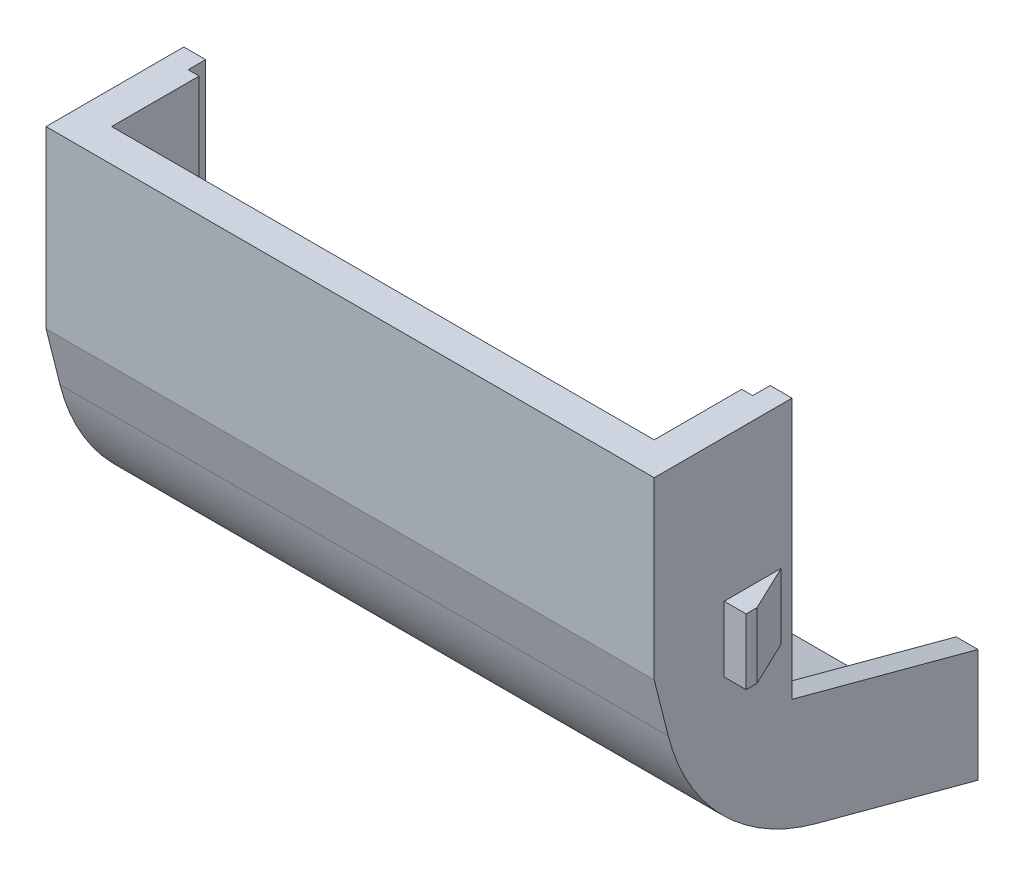
ISO-10303-21;
HEADER;
FILE_DESCRIPTION(('STEP AP214'),'2;1');
FILE_NAME('part.step','',(''),(''),'','','');
FILE_SCHEMA(('AUTOMOTIVE_DESIGN { 1 0 10303 214 1 1 1 1 }'));
ENDSEC;
DATA;
#1=APPLICATION_CONTEXT('core data for automotive mechanical design processes');
#2=APPLICATION_PROTOCOL_DEFINITION('international standard','automotive_design',2000,#1);
#3=PRODUCT_CONTEXT('',#1,'mechanical');
#4=PRODUCT('Part','Part','',(#3));
#5=PRODUCT_RELATED_PRODUCT_CATEGORY('part','',(#4));
#6=PRODUCT_DEFINITION_FORMATION('','',#4);
#7=PRODUCT_DEFINITION_CONTEXT('part definition',#1,'design');
#8=PRODUCT_DEFINITION('design','',#6,#7);
#9=PRODUCT_DEFINITION_SHAPE('','',#8);
#10=(LENGTH_UNIT() NAMED_UNIT(*) SI_UNIT(.MILLI.,.METRE.));
#11=(NAMED_UNIT(*) PLANE_ANGLE_UNIT() SI_UNIT($,.RADIAN.));
#12=(NAMED_UNIT(*) SI_UNIT($,.STERADIAN.) SOLID_ANGLE_UNIT());
#13=UNCERTAINTY_MEASURE_WITH_UNIT(LENGTH_MEASURE(1.E-05),#10,'distance_accuracy_value','');
#14=(GEOMETRIC_REPRESENTATION_CONTEXT(3) GLOBAL_UNCERTAINTY_ASSIGNED_CONTEXT((#13)) GLOBAL_UNIT_ASSIGNED_CONTEXT((#10,
#11,#12)) REPRESENTATION_CONTEXT('',''));
#15=CARTESIAN_POINT('',(0.,0.,0.));
#16=DIRECTION('',(0.,0.,1.));
#17=DIRECTION('',(1.,0.,0.));
#18=AXIS2_PLACEMENT_3D('',#15,#16,#17);
#19=CARTESIAN_POINT('',(0.,0.,7.8));
#20=DIRECTION('',(0.,1.,0.));
#21=DIRECTION('',(0.,0.,1.));
#22=AXIS2_PLACEMENT_3D('',#19,#20,#21);
#23=PLANE('',#22);
#24=DIRECTION('',(0.,0.,-1.));
#25=VECTOR('',#24,1.);
#26=CARTESIAN_POINT('',(1.5,0.,1.5));
#27=LINE('',#26,#25);
#28=CARTESIAN_POINT('',(1.5,0.,6.3));
#29=VERTEX_POINT('',#28);
#30=CARTESIAN_POINT('',(1.5,0.,2.3));
#31=VERTEX_POINT('',#30);
#32=EDGE_CURVE('E500',#29,#31,#27,.T.);
#33=ORIENTED_EDGE('',*,*,#32,.T.);
#34=DIRECTION('',(1.,0.,0.));
#35=VECTOR('',#34,1.);
#36=CARTESIAN_POINT('',(1.,0.,2.3));
#37=LINE('',#36,#35);
#38=CARTESIAN_POINT('',(1.,0.,2.3));
#39=VERTEX_POINT('',#38);
#40=EDGE_CURVE('E255',#39,#31,#37,.T.);
#41=ORIENTED_EDGE('',*,*,#40,.F.);
#42=DIRECTION('',(0.,0.,-1.));
#43=VECTOR('',#42,1.);
#44=CARTESIAN_POINT('',(1.,0.,2.3));
#45=LINE('',#44,#43);
#46=CARTESIAN_POINT('',(1.,0.,1.5));
#47=VERTEX_POINT('',#46);
#48=EDGE_CURVE('E241',#39,#47,#45,.T.);
#49=ORIENTED_EDGE('',*,*,#48,.T.);
#50=DIRECTION('',(1.,0.,0.));
#51=VECTOR('',#50,1.);
#52=CARTESIAN_POINT('',(0.,0.,1.5));
#53=LINE('',#52,#51);
#54=CARTESIAN_POINT('',(0.,0.,1.5));
#55=VERTEX_POINT('',#54);
#56=EDGE_CURVE('E253',#55,#47,#53,.T.);
#57=ORIENTED_EDGE('',*,*,#56,.F.);
#58=DIRECTION('',(0.,0.,-1.));
#59=VECTOR('',#58,1.);
#60=CARTESIAN_POINT('',(0.,0.,7.8));
#61=LINE('',#60,#59);
#62=CARTESIAN_POINT('',(0.,0.,7.8));
#63=VERTEX_POINT('',#62);
#64=EDGE_CURVE('E556',#63,#55,#61,.T.);
#65=ORIENTED_EDGE('',*,*,#64,.F.);
#66=DIRECTION('',(1.,0.,0.));
#67=VECTOR('',#66,1.);
#68=CARTESIAN_POINT('',(0.,0.,7.8));
#69=LINE('',#68,#67);
#70=CARTESIAN_POINT('',(27.8,0.,7.8));
#71=VERTEX_POINT('',#70);
#72=EDGE_CURVE('E486',#63,#71,#69,.T.);
#73=ORIENTED_EDGE('',*,*,#72,.T.);
#74=DIRECTION('',(0.,0.,-1.));
#75=VECTOR('',#74,1.);
#76=CARTESIAN_POINT('',(27.8,0.,7.8));
#77=LINE('',#76,#75);
#78=CARTESIAN_POINT('',(27.8,0.,1.5));
#79=VERTEX_POINT('',#78);
#80=EDGE_CURVE('E559',#71,#79,#77,.T.);
#81=ORIENTED_EDGE('',*,*,#80,.T.);
#82=CARTESIAN_POINT('',(26.8,0.,1.5));
#83=VERTEX_POINT('',#82);
#84=EDGE_CURVE('E265',#83,#79,#53,.T.);
#85=ORIENTED_EDGE('',*,*,#84,.F.);
#86=DIRECTION('',(0.,0.,-1.));
#87=VECTOR('',#86,1.);
#88=CARTESIAN_POINT('',(26.8,0.,2.3));
#89=LINE('',#88,#87);
#90=CARTESIAN_POINT('',(26.8,0.,2.3));
#91=VERTEX_POINT('',#90);
#92=EDGE_CURVE('E386',#91,#83,#89,.T.);
#93=ORIENTED_EDGE('',*,*,#92,.F.);
#94=DIRECTION('',(-1.,0.,0.));
#95=VECTOR('',#94,1.);
#96=CARTESIAN_POINT('',(26.8,0.,2.3));
#97=LINE('',#96,#95);
#98=CARTESIAN_POINT('',(26.3,0.,2.3));
#99=VERTEX_POINT('',#98);
#100=EDGE_CURVE('E381',#91,#99,#97,.T.);
#101=ORIENTED_EDGE('',*,*,#100,.T.);
#102=DIRECTION('',(0.,0.,-1.));
#103=VECTOR('',#102,1.);
#104=CARTESIAN_POINT('',(26.3,0.,1.5));
#105=LINE('',#104,#103);
#106=CARTESIAN_POINT('',(26.3,0.,6.3));
#107=VERTEX_POINT('',#106);
#108=EDGE_CURVE('E502',#107,#99,#105,.T.);
#109=ORIENTED_EDGE('',*,*,#108,.F.);
#110=DIRECTION('',(-1.,0.,0.));
#111=VECTOR('',#110,1.);
#112=CARTESIAN_POINT('',(26.3,0.,6.3));
#113=LINE('',#112,#111);
#114=EDGE_CURVE('E525',#107,#29,#113,.T.);
#115=ORIENTED_EDGE('',*,*,#114,.T.);
#116=EDGE_LOOP('',(#33,#41,#49,#57,#65,#73,#81,#85,#93,#101,#109,#115));
#117=FACE_BOUND('',#116,.T.);
#118=ADVANCED_FACE('F42',(#117),#23,.T.);
#119=CARTESIAN_POINT('',(1.5,0.,0.));
#120=DIRECTION('',(1.,0.,0.));
#121=DIRECTION('',(0.,0.,-1.));
#122=AXIS2_PLACEMENT_3D('',#119,#120,#121);
#123=PLANE('',#122);
#124=DIRECTION('',(0.,1.,0.));
#125=VECTOR('',#124,1.);
#126=CARTESIAN_POINT('',(1.5,-17.8227300764027,-7.));
#127=LINE('',#126,#125);
#128=CARTESIAN_POINT('',(1.5,-17.8227300764027,-7.));
#129=VERTEX_POINT('',#128);
#130=CARTESIAN_POINT('',(1.5,-15.0274843892955,-7.));
#131=VERTEX_POINT('',#130);
#132=EDGE_CURVE('E472',#129,#131,#127,.T.);
#133=ORIENTED_EDGE('',*,*,#132,.T.);
#134=DIRECTION('',(0.,0.258819045102519,0.965925826289069));
#135=VECTOR('',#134,1.);
#136=CARTESIAN_POINT('',(1.5,-12.5355568996861,2.3));
#137=LINE('',#136,#135);
#138=CARTESIAN_POINT('',(1.5,-12.5355568996861,2.3));
#139=VERTEX_POINT('',#138);
#140=EDGE_CURVE('E248',#131,#139,#137,.T.);
#141=ORIENTED_EDGE('',*,*,#140,.T.);
#142=DIRECTION('',(0.,1.,0.));
#143=VECTOR('',#142,1.);
#144=CARTESIAN_POINT('',(1.5,0.,2.3));
#145=LINE('',#144,#143);
#146=EDGE_CURVE('E430',#139,#31,#145,.T.);
#147=ORIENTED_EDGE('',*,*,#146,.T.);
#148=ORIENTED_EDGE('',*,*,#32,.F.);
#149=DIRECTION('',(0.,1.,0.));
#150=VECTOR('',#149,1.);
#151=CARTESIAN_POINT('',(1.5,0.,6.3));
#152=LINE('',#151,#150);
#153=CARTESIAN_POINT('',(1.5,-7.8137485816425,6.3));
#154=VERTEX_POINT('',#153);
#155=EDGE_CURVE('E463',#154,#29,#152,.T.);
#156=ORIENTED_EDGE('',*,*,#155,.F.);
#157=DIRECTION('',(0.,0.969632994364522,0.244564625896081));
#158=VECTOR('',#157,1.);
#159=CARTESIAN_POINT('',(1.5,-14.726169280763,4.55652221805358));
#160=LINE('',#159,#158);
#161=CARTESIAN_POINT('',(1.5,-10.1711318952813,5.70541156133863));
#162=VERTEX_POINT('',#161);
#163=EDGE_CURVE('E462',#162,#154,#160,.T.);
#164=ORIENTED_EDGE('',*,*,#163,.F.);
#165=CARTESIAN_POINT('',(1.5,-8.2146148881127,-2.05165239357755));
#166=DIRECTION('',(1.,0.,0.));
#167=DIRECTION('',(0.,0.,-1.));
#168=AXIS2_PLACEMENT_3D('',#165,#166,#167);
#169=CIRCLE('',#168,8.);
#170=CARTESIAN_POINT('',(1.5,-15.9420214984252,0.0188999672425996));
#171=VERTEX_POINT('',#170);
#172=EDGE_CURVE('E479',#162,#171,#169,.T.);
#173=ORIENTED_EDGE('',*,*,#172,.T.);
#174=DIRECTION('',(0.,0.258819045102518,0.965925826289069));
#175=VECTOR('',#174,1.);
#176=CARTESIAN_POINT('',(1.5,-14.726169280763,4.55652221805358));
#177=LINE('',#176,#175);
#178=EDGE_CURVE('E464',#129,#171,#177,.T.);
#179=ORIENTED_EDGE('',*,*,#178,.F.);
#180=EDGE_LOOP('',(#133,#141,#147,#148,#156,#164,#173,#179));
#181=FACE_BOUND('',#180,.T.);
#182=ADVANCED_FACE('F612',(#181),#123,.T.);
#183=CARTESIAN_POINT('',(-11.0925643625543,-19.3756443470178,-7.));
#184=DIRECTION('',(0.,0.,-1.));
#185=DIRECTION('',(0.,1.,0.));
#186=AXIS2_PLACEMENT_3D('',#183,#184,#185);
#187=PLANE('',#186);
#188=DIRECTION('',(0.,-1.,0.));
#189=VECTOR('',#188,1.);
#190=CARTESIAN_POINT('',(1.,-15.0274843892955,-7.));
#191=LINE('',#190,#189);
#192=CARTESIAN_POINT('',(1.,-14.1992634449674,-7.));
#193=VERTEX_POINT('',#192);
#194=CARTESIAN_POINT('',(1.,-15.0274843892955,-7.));
#195=VERTEX_POINT('',#194);
#196=EDGE_CURVE('E436',#193,#195,#191,.T.);
#197=ORIENTED_EDGE('',*,*,#196,.T.);
#198=DIRECTION('',(1.,0.,0.));
#199=VECTOR('',#198,1.);
#200=CARTESIAN_POINT('',(1.,-15.0274843892955,-7.));
#201=LINE('',#200,#199);
#202=EDGE_CURVE('E399',#195,#131,#201,.T.);
#203=ORIENTED_EDGE('',*,*,#202,.T.);
#204=ORIENTED_EDGE('',*,*,#132,.F.);
#205=DIRECTION('',(1.,0.,0.));
#206=VECTOR('',#205,1.);
#207=CARTESIAN_POINT('',(-7.40169767815913,-17.8227300764027,-7.));
#208=LINE('',#207,#206);
#209=CARTESIAN_POINT('',(26.3,-17.8227300764027,-7.));
#210=VERTEX_POINT('',#209);
#211=EDGE_CURVE('E474',#129,#210,#208,.T.);
#212=ORIENTED_EDGE('',*,*,#211,.T.);
#213=DIRECTION('',(0.,-1.,0.));
#214=VECTOR('',#213,1.);
#215=CARTESIAN_POINT('',(26.3,-17.8227300764027,-7.));
#216=LINE('',#215,#214);
#217=CARTESIAN_POINT('',(26.3,-15.0274843892955,-7.));
#218=VERTEX_POINT('',#217);
#219=EDGE_CURVE('E269',#218,#210,#216,.T.);
#220=ORIENTED_EDGE('',*,*,#219,.F.);
#221=DIRECTION('',(-1.,0.,0.));
#222=VECTOR('',#221,1.);
#223=CARTESIAN_POINT('',(26.8,-15.0274843892955,-7.));
#224=LINE('',#223,#222);
#225=CARTESIAN_POINT('',(26.8,-15.0274843892955,-7.));
#226=VERTEX_POINT('',#225);
#227=EDGE_CURVE('E382',#226,#218,#224,.T.);
#228=ORIENTED_EDGE('',*,*,#227,.F.);
#229=DIRECTION('',(0.,-1.,0.));
#230=VECTOR('',#229,1.);
#231=CARTESIAN_POINT('',(26.8,-15.0274843892955,-7.));
#232=LINE('',#231,#230);
#233=CARTESIAN_POINT('',(26.8,-14.1992634449674,-7.));
#234=VERTEX_POINT('',#233);
#235=EDGE_CURVE('E410',#234,#226,#232,.T.);
#236=ORIENTED_EDGE('',*,*,#235,.F.);
#237=DIRECTION('',(1.,0.,0.));
#238=VECTOR('',#237,1.);
#239=CARTESIAN_POINT('',(-25.5954133330598,-14.1992634449674,-7.));
#240=LINE('',#239,#238);
#241=CARTESIAN_POINT('',(27.8,-14.1992634449674,-7.));
#242=VERTEX_POINT('',#241);
#243=EDGE_CURVE('E298',#234,#242,#240,.T.);
#244=ORIENTED_EDGE('',*,*,#243,.T.);
#245=DIRECTION('',(0.,1.,0.));
#246=VECTOR('',#245,1.);
#247=CARTESIAN_POINT('',(27.8,-19.3756443470178,-7.));
#248=LINE('',#247,#246);
#249=CARTESIAN_POINT('',(27.8,-19.3756443470178,-7.));
#250=VERTEX_POINT('',#249);
#251=EDGE_CURVE('E473',#250,#242,#248,.T.);
#252=ORIENTED_EDGE('',*,*,#251,.F.);
#253=DIRECTION('',(1.,0.,0.));
#254=VECTOR('',#253,1.);
#255=CARTESIAN_POINT('',(-11.0925643625543,-19.3756443470178,-7.));
#256=LINE('',#255,#254);
#257=CARTESIAN_POINT('',(0.,-19.3756443470178,-7.));
#258=VERTEX_POINT('',#257);
#259=EDGE_CURVE('E490',#258,#250,#256,.T.);
#260=ORIENTED_EDGE('',*,*,#259,.F.);
#261=DIRECTION('',(0.,1.,0.));
#262=VECTOR('',#261,1.);
#263=CARTESIAN_POINT('',(0.,-19.3756443470178,-7.));
#264=LINE('',#263,#262);
#265=CARTESIAN_POINT('',(0.,-14.1992634449674,-7.));
#266=VERTEX_POINT('',#265);
#267=EDGE_CURVE('E459',#258,#266,#264,.T.);
#268=ORIENTED_EDGE('',*,*,#267,.T.);
#269=EDGE_CURVE('E290',#266,#193,#240,.T.);
#270=ORIENTED_EDGE('',*,*,#269,.T.);
#271=EDGE_LOOP('',(#197,#203,#204,#212,#220,#228,#236,#244,#252,#260,#268,#270));
#272=FACE_BOUND('',#271,.T.);
#273=ADVANCED_FACE('F453',(#272),#187,.T.);
#274=CARTESIAN_POINT('',(27.8,0.,7.8));
#275=DIRECTION('',(1.,0.,0.));
#276=DIRECTION('',(0.,0.,-1.));
#277=AXIS2_PLACEMENT_3D('',#274,#275,#276);
#278=PLANE('',#277);
#279=DIRECTION('',(0.,-1.,0.));
#280=VECTOR('',#279,1.);
#281=CARTESIAN_POINT('',(27.8,0.,1.5));
#282=LINE('',#281,#280);
#283=CARTESIAN_POINT('',(27.8,-11.9216953093029,1.5));
#284=VERTEX_POINT('',#283);
#285=EDGE_CURVE('E263',#79,#284,#282,.T.);
#286=ORIENTED_EDGE('',*,*,#285,.F.);
#287=ORIENTED_EDGE('',*,*,#80,.F.);
#288=DIRECTION('',(0.,-1.,0.));
#289=VECTOR('',#288,1.);
#290=CARTESIAN_POINT('',(27.8,0.,7.8));
#291=LINE('',#290,#289);
#292=CARTESIAN_POINT('',(27.8,-8.,7.8));
#293=VERTEX_POINT('',#292);
#294=EDGE_CURVE('E483',#71,#293,#291,.T.);
#295=ORIENTED_EDGE('',*,*,#294,.T.);
#296=DIRECTION('',(0.,0.969632994364523,0.244564625896081));
#297=VECTOR('',#296,1.);
#298=CARTESIAN_POINT('',(27.8,-8.,7.8));
#299=LINE('',#298,#297);
#300=CARTESIAN_POINT('',(27.8,-10.5379788341255,7.15986105288542));
#301=VERTEX_POINT('',#300);
#302=EDGE_CURVE('E540',#301,#293,#299,.T.);
#303=ORIENTED_EDGE('',*,*,#302,.F.);
#304=CARTESIAN_POINT('',(27.8,-8.2146148881127,-2.05165239357755));
#305=DIRECTION('',(1.,0.,0.));
#306=DIRECTION('',(0.,0.,-1.));
#307=AXIS2_PLACEMENT_3D('',#304,#305,#306);
#308=CIRCLE('',#307,9.5);
#309=CARTESIAN_POINT('',(27.8,-17.3909102378589,0.407128534896375));
#310=VERTEX_POINT('',#309);
#311=EDGE_CURVE('E11',#301,#310,#308,.T.);
#312=ORIENTED_EDGE('',*,*,#311,.T.);
#313=DIRECTION('',(0.,0.258819045102518,0.965925826289069));
#314=VECTOR('',#313,1.);
#315=CARTESIAN_POINT('',(27.8,-15.9470857293849,5.79555495773442));
#316=LINE('',#315,#314);
#317=EDGE_CURVE('E536',#250,#310,#316,.T.);
#318=ORIENTED_EDGE('',*,*,#317,.F.);
#319=ORIENTED_EDGE('',*,*,#251,.T.);
#320=DIRECTION('',(0.,-0.258819045102519,-0.965925826289069));
#321=VECTOR('',#320,1.);
#322=CARTESIAN_POINT('',(27.8,-9.54809315166853,10.3584038492467));
#323=LINE('',#322,#321);
#324=EDGE_CURVE('E283',#284,#242,#323,.T.);
#325=ORIENTED_EDGE('',*,*,#324,.F.);
#326=EDGE_LOOP('',(#286,#287,#295,#303,#312,#318,#319,#325));
#327=FACE_BOUND('',#326,.T.);
#328=DIRECTION('',(0.,-1.,0.));
#329=VECTOR('',#328,1.);
#330=CARTESIAN_POINT('',(27.8,-6.49,2.));
#331=LINE('',#330,#329);
#332=CARTESIAN_POINT('',(27.8,-6.49,2.));
#333=VERTEX_POINT('',#332);
#334=CARTESIAN_POINT('',(27.8,-9.49,2.));
#335=VERTEX_POINT('',#334);
#336=EDGE_CURVE('E377',#333,#335,#331,.T.);
#337=ORIENTED_EDGE('',*,*,#336,.T.);
#338=DIRECTION('',(0.,0.,1.));
#339=VECTOR('',#338,1.);
#340=CARTESIAN_POINT('',(27.8,-9.49,2.));
#341=LINE('',#340,#339);
#342=CARTESIAN_POINT('',(27.8,-9.49,4.6));
#343=VERTEX_POINT('',#342);
#344=EDGE_CURVE('E338',#335,#343,#341,.T.);
#345=ORIENTED_EDGE('',*,*,#344,.T.);
#346=DIRECTION('',(0.,1.,0.));
#347=VECTOR('',#346,1.);
#348=CARTESIAN_POINT('',(27.8,-9.49,4.6));
#349=LINE('',#348,#347);
#350=CARTESIAN_POINT('',(27.8,-6.49,4.6));
#351=VERTEX_POINT('',#350);
#352=EDGE_CURVE('E344',#343,#351,#349,.T.);
#353=ORIENTED_EDGE('',*,*,#352,.T.);
#354=DIRECTION('',(0.,0.,-1.));
#355=VECTOR('',#354,1.);
#356=CARTESIAN_POINT('',(27.8,-6.49,4.6));
#357=LINE('',#356,#355);
#358=EDGE_CURVE('E351',#351,#333,#357,.T.);
#359=ORIENTED_EDGE('',*,*,#358,.T.);
#360=EDGE_LOOP('',(#337,#345,#353,#359));
#361=FACE_BOUND('',#360,.T.);
#362=ADVANCED_FACE('F582',(#327,#361),#278,.T.);
#363=CARTESIAN_POINT('',(0.,0.,7.8));
#364=DIRECTION('',(-1.,0.,0.));
#365=DIRECTION('',(0.,0.,1.));
#366=AXIS2_PLACEMENT_3D('',#363,#364,#365);
#367=PLANE('',#366);
#368=DIRECTION('',(0.,1.,0.));
#369=VECTOR('',#368,1.);
#370=CARTESIAN_POINT('',(0.,0.,1.5));
#371=LINE('',#370,#369);
#372=CARTESIAN_POINT('',(0.,-11.9216953093029,1.5));
#373=VERTEX_POINT('',#372);
#374=EDGE_CURVE('E261',#373,#55,#371,.T.);
#375=ORIENTED_EDGE('',*,*,#374,.F.);
#376=DIRECTION('',(0.,0.258819045102519,0.965925826289069));
#377=VECTOR('',#376,1.);
#378=CARTESIAN_POINT('',(0.,-9.54809315166853,10.3584038492467));
#379=LINE('',#378,#377);
#380=EDGE_CURVE('E276',#266,#373,#379,.T.);
#381=ORIENTED_EDGE('',*,*,#380,.F.);
#382=ORIENTED_EDGE('',*,*,#267,.F.);
#383=DIRECTION('',(0.,0.258819045102518,0.965925826289069));
#384=VECTOR('',#383,1.);
#385=CARTESIAN_POINT('',(0.,-15.9470857293849,5.79555495773442));
#386=LINE('',#385,#384);
#387=CARTESIAN_POINT('',(0.,-17.3909102378589,0.407128534896379));
#388=VERTEX_POINT('',#387);
#389=EDGE_CURVE('E529',#258,#388,#386,.T.);
#390=ORIENTED_EDGE('',*,*,#389,.T.);
#391=CARTESIAN_POINT('',(0.,-8.2146148881127,-2.05165239357755));
#392=DIRECTION('',(-1.,0.,0.));
#393=DIRECTION('',(0.,0.,1.));
#394=AXIS2_PLACEMENT_3D('',#391,#392,#393);
#395=CIRCLE('',#394,9.5);
#396=CARTESIAN_POINT('',(0.,-10.5379788341255,7.15986105288542));
#397=VERTEX_POINT('',#396);
#398=EDGE_CURVE('E571',#388,#397,#395,.T.);
#399=ORIENTED_EDGE('',*,*,#398,.T.);
#400=DIRECTION('',(0.,0.969632994364522,0.244564625896081));
#401=VECTOR('',#400,1.);
#402=CARTESIAN_POINT('',(0.,-8.,7.8));
#403=LINE('',#402,#401);
#404=CARTESIAN_POINT('',(0.,-8.,7.8));
#405=VERTEX_POINT('',#404);
#406=EDGE_CURVE('E533',#397,#405,#403,.T.);
#407=ORIENTED_EDGE('',*,*,#406,.T.);
#408=DIRECTION('',(0.,1.,0.));
#409=VECTOR('',#408,1.);
#410=CARTESIAN_POINT('',(0.,0.,7.8));
#411=LINE('',#410,#409);
#412=EDGE_CURVE('E543',#405,#63,#411,.T.);
#413=ORIENTED_EDGE('',*,*,#412,.T.);
#414=ORIENTED_EDGE('',*,*,#64,.T.);
#415=EDGE_LOOP('',(#375,#381,#382,#390,#399,#407,#413,#414));
#416=FACE_BOUND('',#415,.T.);
#417=DIRECTION('',(0.,0.,1.));
#418=VECTOR('',#417,1.);
#419=CARTESIAN_POINT('',(0.,-9.49,2.));
#420=LINE('',#419,#418);
#421=CARTESIAN_POINT('',(0.,-9.49,2.));
#422=VERTEX_POINT('',#421);
#423=CARTESIAN_POINT('',(0.,-9.49,4.6));
#424=VERTEX_POINT('',#423);
#425=EDGE_CURVE('E317',#422,#424,#420,.T.);
#426=ORIENTED_EDGE('',*,*,#425,.F.);
#427=DIRECTION('',(0.,-1.,0.));
#428=VECTOR('',#427,1.);
#429=CARTESIAN_POINT('',(0.,-6.49,2.));
#430=LINE('',#429,#428);
#431=CARTESIAN_POINT('',(0.,-6.49,2.));
#432=VERTEX_POINT('',#431);
#433=EDGE_CURVE('E319',#432,#422,#430,.T.);
#434=ORIENTED_EDGE('',*,*,#433,.F.);
#435=DIRECTION('',(0.,0.,-1.));
#436=VECTOR('',#435,1.);
#437=CARTESIAN_POINT('',(0.,-6.49,4.6));
#438=LINE('',#437,#436);
#439=CARTESIAN_POINT('',(0.,-6.49,4.6));
#440=VERTEX_POINT('',#439);
#441=EDGE_CURVE('E308',#440,#432,#438,.T.);
#442=ORIENTED_EDGE('',*,*,#441,.F.);
#443=DIRECTION('',(0.,1.,0.));
#444=VECTOR('',#443,1.);
#445=CARTESIAN_POINT('',(0.,-9.49,4.6));
#446=LINE('',#445,#444);
#447=EDGE_CURVE('E313',#424,#440,#446,.T.);
#448=ORIENTED_EDGE('',*,*,#447,.F.);
#449=EDGE_LOOP('',(#426,#434,#442,#448));
#450=FACE_BOUND('',#449,.T.);
#451=ADVANCED_FACE('F589',(#416,#450),#367,.T.);
#452=CARTESIAN_POINT('',(0.,0.,7.8));
#453=DIRECTION('',(0.,0.,1.));
#454=DIRECTION('',(1.,0.,0.));
#455=AXIS2_PLACEMENT_3D('',#452,#453,#454);
#456=PLANE('',#455);
#457=ORIENTED_EDGE('',*,*,#412,.F.);
#458=DIRECTION('',(-1.,0.,0.));
#459=VECTOR('',#458,1.);
#460=CARTESIAN_POINT('',(0.,-8.,7.8));
#461=LINE('',#460,#459);
#462=EDGE_CURVE('E487',#293,#405,#461,.T.);
#463=ORIENTED_EDGE('',*,*,#462,.F.);
#464=ORIENTED_EDGE('',*,*,#294,.F.);
#465=ORIENTED_EDGE('',*,*,#72,.F.);
#466=EDGE_LOOP('',(#457,#463,#464,#465));
#467=FACE_BOUND('',#466,.T.);
#468=ADVANCED_FACE('F601',(#467),#456,.T.);
#469=CARTESIAN_POINT('',(40.0918672300021,-15.9470857293849,5.79555495773442));
#470=DIRECTION('',(0.,-0.965925826289069,0.258819045102518));
#471=DIRECTION('',(0.,-0.258819045102518,-0.965925826289069));
#472=AXIS2_PLACEMENT_3D('',#469,#470,#471);
#473=PLANE('',#472);
#474=ORIENTED_EDGE('',*,*,#317,.T.);
#475=DIRECTION('',(-1.,0.,0.));
#476=VECTOR('',#475,1.);
#477=CARTESIAN_POINT('',(40.0918672300021,-17.3909102378589,0.407128534896376));
#478=LINE('',#477,#476);
#479=EDGE_CURVE('E468',#310,#388,#478,.T.);
#480=ORIENTED_EDGE('',*,*,#479,.T.);
#481=ORIENTED_EDGE('',*,*,#389,.F.);
#482=ORIENTED_EDGE('',*,*,#259,.T.);
#483=EDGE_LOOP('',(#474,#480,#481,#482));
#484=FACE_BOUND('',#483,.T.);
#485=ADVANCED_FACE('F587',(#484),#473,.T.);
#486=CARTESIAN_POINT('',(40.0918672300021,-8.,7.8));
#487=DIRECTION('',(0.,-0.244564625896081,0.969632994364522));
#488=DIRECTION('',(0.,-0.969632994364523,-0.244564625896081));
#489=AXIS2_PLACEMENT_3D('',#486,#487,#488);
#490=PLANE('',#489);
#491=ORIENTED_EDGE('',*,*,#406,.F.);
#492=DIRECTION('',(-1.,0.,0.));
#493=VECTOR('',#492,1.);
#494=CARTESIAN_POINT('',(40.0918672300021,-10.5379788341255,7.15986105288542));
#495=LINE('',#494,#493);
#496=EDGE_CURVE('E51',#397,#301,#495,.F.);
#497=ORIENTED_EDGE('',*,*,#496,.T.);
#498=ORIENTED_EDGE('',*,*,#302,.T.);
#499=ORIENTED_EDGE('',*,*,#462,.T.);
#500=EDGE_LOOP('',(#491,#497,#498,#499));
#501=FACE_BOUND('',#500,.T.);
#502=ADVANCED_FACE('F578',(#501),#490,.T.);
#503=CARTESIAN_POINT('',(26.3,0.,6.3));
#504=DIRECTION('',(0.,0.,1.));
#505=DIRECTION('',(0.,-1.,0.));
#506=AXIS2_PLACEMENT_3D('',#503,#504,#505);
#507=PLANE('',#506);
#508=ORIENTED_EDGE('',*,*,#155,.T.);
#509=ORIENTED_EDGE('',*,*,#114,.F.);
#510=DIRECTION('',(0.,1.,0.));
#511=VECTOR('',#510,1.);
#512=CARTESIAN_POINT('',(26.3,0.,6.3));
#513=LINE('',#512,#511);
#514=CARTESIAN_POINT('',(26.3,-7.8137485816425,6.3));
#515=VERTEX_POINT('',#514);
#516=EDGE_CURVE('E512',#515,#107,#513,.T.);
#517=ORIENTED_EDGE('',*,*,#516,.F.);
#518=DIRECTION('',(-1.,0.,0.));
#519=VECTOR('',#518,1.);
#520=CARTESIAN_POINT('',(26.3,-7.8137485816425,6.3));
#521=LINE('',#520,#519);
#522=EDGE_CURVE('E516',#515,#154,#521,.T.);
#523=ORIENTED_EDGE('',*,*,#522,.T.);
#524=EDGE_LOOP('',(#508,#509,#517,#523));
#525=FACE_BOUND('',#524,.T.);
#526=ADVANCED_FACE('F644',(#525),#507,.F.);
#527=CARTESIAN_POINT('',(26.3,-14.726169280763,4.55652221805358));
#528=DIRECTION('',(0.,-0.244564625896081,0.969632994364522));
#529=DIRECTION('',(0.,-0.969632994364522,-0.244564625896081));
#530=AXIS2_PLACEMENT_3D('',#527,#528,#529);
#531=PLANE('',#530);
#532=DIRECTION('',(0.,0.969632994364522,0.244564625896081));
#533=VECTOR('',#532,1.);
#534=CARTESIAN_POINT('',(26.3,-14.726169280763,4.55652221805358));
#535=LINE('',#534,#533);
#536=CARTESIAN_POINT('',(26.3,-10.1711318952813,5.70541156133863));
#537=VERTEX_POINT('',#536);
#538=EDGE_CURVE('E509',#537,#515,#535,.T.);
#539=ORIENTED_EDGE('',*,*,#538,.F.);
#540=DIRECTION('',(-1.,0.,0.));
#541=VECTOR('',#540,1.);
#542=CARTESIAN_POINT('',(1.5,-10.1711318952813,5.70541156133863));
#543=LINE('',#542,#541);
#544=EDGE_CURVE('E480',#537,#162,#543,.T.);
#545=ORIENTED_EDGE('',*,*,#544,.T.);
#546=ORIENTED_EDGE('',*,*,#163,.T.);
#547=ORIENTED_EDGE('',*,*,#522,.F.);
#548=EDGE_LOOP('',(#539,#545,#546,#547));
#549=FACE_BOUND('',#548,.T.);
#550=ADVANCED_FACE('F639',(#549),#531,.F.);
#551=CARTESIAN_POINT('',(26.3,-14.726169280763,4.55652221805358));
#552=DIRECTION('',(0.,-0.965925826289069,0.258819045102518));
#553=DIRECTION('',(0.,-0.258819045102518,-0.965925826289069));
#554=AXIS2_PLACEMENT_3D('',#551,#552,#553);
#555=PLANE('',#554);
#556=ORIENTED_EDGE('',*,*,#178,.T.);
#557=DIRECTION('',(-1.,0.,0.));
#558=VECTOR('',#557,1.);
#559=CARTESIAN_POINT('',(26.3,-15.9420214984252,0.0188999672425987));
#560=LINE('',#559,#558);
#561=CARTESIAN_POINT('',(26.3,-15.9420214984252,0.0188999672425996));
#562=VERTEX_POINT('',#561);
#563=EDGE_CURVE('E469',#171,#562,#560,.F.);
#564=ORIENTED_EDGE('',*,*,#563,.T.);
#565=DIRECTION('',(0.,0.258819045102518,0.965925826289069));
#566=VECTOR('',#565,1.);
#567=CARTESIAN_POINT('',(26.3,-14.726169280763,4.55652221805358));
#568=LINE('',#567,#566);
#569=EDGE_CURVE('E505',#210,#562,#568,.T.);
#570=ORIENTED_EDGE('',*,*,#569,.F.);
#571=ORIENTED_EDGE('',*,*,#211,.F.);
#572=EDGE_LOOP('',(#556,#564,#570,#571));
#573=FACE_BOUND('',#572,.T.);
#574=ADVANCED_FACE('F629',(#573),#555,.F.);
#575=CARTESIAN_POINT('',(26.3,0.,0.));
#576=DIRECTION('',(1.,0.,0.));
#577=DIRECTION('',(0.,0.,-1.));
#578=AXIS2_PLACEMENT_3D('',#575,#576,#577);
#579=PLANE('',#578);
#580=ORIENTED_EDGE('',*,*,#108,.T.);
#581=DIRECTION('',(0.,1.,0.));
#582=VECTOR('',#581,1.);
#583=CARTESIAN_POINT('',(26.3,0.,2.3));
#584=LINE('',#583,#582);
#585=CARTESIAN_POINT('',(26.3,-12.5355568996861,2.3));
#586=VERTEX_POINT('',#585);
#587=EDGE_CURVE('E392',#586,#99,#584,.T.);
#588=ORIENTED_EDGE('',*,*,#587,.F.);
#589=DIRECTION('',(0.,0.258819045102519,0.965925826289069));
#590=VECTOR('',#589,1.);
#591=CARTESIAN_POINT('',(26.3,-12.5355568996861,2.3));
#592=LINE('',#591,#590);
#593=EDGE_CURVE('E395',#218,#586,#592,.T.);
#594=ORIENTED_EDGE('',*,*,#593,.F.);
#595=ORIENTED_EDGE('',*,*,#219,.T.);
#596=ORIENTED_EDGE('',*,*,#569,.T.);
#597=CARTESIAN_POINT('',(26.3,-8.2146148881127,-2.05165239357755));
#598=DIRECTION('',(1.,0.,0.));
#599=DIRECTION('',(0.,0.,-1.));
#600=AXIS2_PLACEMENT_3D('',#597,#598,#599);
#601=CIRCLE('',#600,8.);
#602=EDGE_CURVE('E467',#562,#537,#601,.F.);
#603=ORIENTED_EDGE('',*,*,#602,.T.);
#604=ORIENTED_EDGE('',*,*,#538,.T.);
#605=ORIENTED_EDGE('',*,*,#516,.T.);
#606=EDGE_LOOP('',(#580,#588,#594,#595,#596,#603,#604,#605));
#607=FACE_BOUND('',#606,.T.);
#608=ADVANCED_FACE('F622',(#607),#579,.F.);
#609=CARTESIAN_POINT('',(26.3,-8.2146148881127,-2.05165239357755));
#610=DIRECTION('',(1.,0.,0.));
#611=DIRECTION('',(0.,0.,-1.));
#612=AXIS2_PLACEMENT_3D('',#609,#610,#611);
#613=CYLINDRICAL_SURFACE('',#612,8.);
#614=ORIENTED_EDGE('',*,*,#602,.F.);
#615=ORIENTED_EDGE('',*,*,#563,.F.);
#616=ORIENTED_EDGE('',*,*,#172,.F.);
#617=ORIENTED_EDGE('',*,*,#544,.F.);
#618=EDGE_LOOP('',(#614,#615,#616,#617));
#619=FACE_BOUND('',#618,.T.);
#620=ADVANCED_FACE('F620',(#619),#613,.F.);
#621=CARTESIAN_POINT('',(40.0918672300021,-8.2146148881127,-2.05165239357755));
#622=DIRECTION('',(-1.,0.,0.));
#623=DIRECTION('',(0.,0.,1.));
#624=AXIS2_PLACEMENT_3D('',#621,#622,#623);
#625=CYLINDRICAL_SURFACE('',#624,9.5);
#626=ORIENTED_EDGE('',*,*,#311,.F.);
#627=ORIENTED_EDGE('',*,*,#496,.F.);
#628=ORIENTED_EDGE('',*,*,#398,.F.);
#629=ORIENTED_EDGE('',*,*,#479,.F.);
#630=EDGE_LOOP('',(#626,#627,#628,#629));
#631=FACE_BOUND('',#630,.T.);
#632=ADVANCED_FACE('F44',(#631),#625,.T.);
#633=CARTESIAN_POINT('',(-25.5954133330598,-14.1992634449674,-7.));
#634=DIRECTION('',(0.,-0.965925826289069,0.258819045102519));
#635=DIRECTION('',(0.,-0.258819045102519,-0.965925826289069));
#636=AXIS2_PLACEMENT_3D('',#633,#634,#635);
#637=PLANE('',#636);
#638=DIRECTION('',(1.,0.,0.));
#639=VECTOR('',#638,1.);
#640=CARTESIAN_POINT('',(-25.5954133330598,-11.9216953093029,1.5));
#641=LINE('',#640,#639);
#642=CARTESIAN_POINT('',(1.,-11.9216953093029,1.5));
#643=VERTEX_POINT('',#642);
#644=EDGE_CURVE('E296',#373,#643,#641,.T.);
#645=ORIENTED_EDGE('',*,*,#644,.T.);
#646=DIRECTION('',(0.,-0.258819045102519,-0.965925826289069));
#647=VECTOR('',#646,1.);
#648=CARTESIAN_POINT('',(1.,-14.1992634449674,-7.));
#649=LINE('',#648,#647);
#650=EDGE_CURVE('E58',#643,#193,#649,.T.);
#651=ORIENTED_EDGE('',*,*,#650,.T.);
#652=ORIENTED_EDGE('',*,*,#269,.F.);
#653=ORIENTED_EDGE('',*,*,#380,.T.);
#654=EDGE_LOOP('',(#645,#651,#652,#653));
#655=FACE_BOUND('',#654,.T.);
#656=ADVANCED_FACE('F628',(#655),#637,.F.);
#657=CARTESIAN_POINT('',(-25.5954133330598,-11.9216953093029,1.5));
#658=DIRECTION('',(0.,0.,1.));
#659=DIRECTION('',(1.,0.,0.));
#660=AXIS2_PLACEMENT_3D('',#657,#658,#659);
#661=PLANE('',#660);
#662=ORIENTED_EDGE('',*,*,#56,.T.);
#663=DIRECTION('',(0.,-1.,0.));
#664=VECTOR('',#663,1.);
#665=CARTESIAN_POINT('',(1.,0.,1.5));
#666=LINE('',#665,#664);
#667=EDGE_CURVE('E237',#47,#643,#666,.T.);
#668=ORIENTED_EDGE('',*,*,#667,.T.);
#669=ORIENTED_EDGE('',*,*,#644,.F.);
#670=ORIENTED_EDGE('',*,*,#374,.T.);
#671=EDGE_LOOP('',(#662,#668,#669,#670));
#672=FACE_BOUND('',#671,.T.);
#673=ADVANCED_FACE('F259',(#672),#661,.F.);
#674=CARTESIAN_POINT('',(26.8,-11.9216953093029,1.5));
#675=VERTEX_POINT('',#674);
#676=EDGE_CURVE('E293',#675,#284,#641,.T.);
#677=ORIENTED_EDGE('',*,*,#676,.F.);
#678=DIRECTION('',(0.,-1.,0.));
#679=VECTOR('',#678,1.);
#680=CARTESIAN_POINT('',(26.8,0.,1.5));
#681=LINE('',#680,#679);
#682=EDGE_CURVE('E66',#83,#675,#681,.T.);
#683=ORIENTED_EDGE('',*,*,#682,.F.);
#684=ORIENTED_EDGE('',*,*,#84,.T.);
#685=ORIENTED_EDGE('',*,*,#285,.T.);
#686=EDGE_LOOP('',(#677,#683,#684,#685));
#687=FACE_BOUND('',#686,.T.);
#688=ADVANCED_FACE('F718',(#687),#661,.F.);
#689=ORIENTED_EDGE('',*,*,#243,.F.);
#690=DIRECTION('',(0.,-0.258819045102519,-0.965925826289069));
#691=VECTOR('',#690,1.);
#692=CARTESIAN_POINT('',(26.8,-14.1992634449674,-7.));
#693=LINE('',#692,#691);
#694=EDGE_CURVE('E414',#675,#234,#693,.T.);
#695=ORIENTED_EDGE('',*,*,#694,.F.);
#696=ORIENTED_EDGE('',*,*,#676,.T.);
#697=ORIENTED_EDGE('',*,*,#324,.T.);
#698=EDGE_LOOP('',(#689,#695,#696,#697));
#699=FACE_BOUND('',#698,.T.);
#700=ADVANCED_FACE('F595',(#699),#637,.F.);
#701=CARTESIAN_POINT('',(-1.,-9.49,2.));
#702=DIRECTION('',(0.,1.,0.));
#703=DIRECTION('',(0.,0.,1.));
#704=AXIS2_PLACEMENT_3D('',#701,#702,#703);
#705=PLANE('',#704);
#706=DIRECTION('',(0.,0.,1.));
#707=VECTOR('',#706,1.);
#708=CARTESIAN_POINT('',(-1.,-9.49,2.));
#709=LINE('',#708,#707);
#710=CARTESIAN_POINT('',(-1.,-9.49,4.1));
#711=VERTEX_POINT('',#710);
#712=CARTESIAN_POINT('',(-1.,-9.49,4.6));
#713=VERTEX_POINT('',#712);
#714=EDGE_CURVE('E312',#711,#713,#709,.T.);
#715=ORIENTED_EDGE('',*,*,#714,.F.);
#716=DIRECTION('',(-0.429933580392348,0.,0.90286051882393));
#717=VECTOR('',#716,1.);
#718=CARTESIAN_POINT('',(0.,-9.49,2.));
#719=LINE('',#718,#717);
#720=EDGE_CURVE('E335',#422,#711,#719,.T.);
#721=ORIENTED_EDGE('',*,*,#720,.F.);
#722=ORIENTED_EDGE('',*,*,#425,.T.);
#723=DIRECTION('',(1.,0.,0.));
#724=VECTOR('',#723,1.);
#725=CARTESIAN_POINT('',(-1.,-9.49,4.6));
#726=LINE('',#725,#724);
#727=EDGE_CURVE('E297',#713,#424,#726,.T.);
#728=ORIENTED_EDGE('',*,*,#727,.F.);
#729=EDGE_LOOP('',(#715,#721,#722,#728));
#730=FACE_BOUND('',#729,.T.);
#731=ADVANCED_FACE('F709',(#730),#705,.F.);
#732=CARTESIAN_POINT('',(-1.,-9.49,4.6));
#733=DIRECTION('',(0.,0.,-1.));
#734=DIRECTION('',(0.,1.,0.));
#735=AXIS2_PLACEMENT_3D('',#732,#733,#734);
#736=PLANE('',#735);
#737=ORIENTED_EDGE('',*,*,#447,.T.);
#738=DIRECTION('',(1.,0.,0.));
#739=VECTOR('',#738,1.);
#740=CARTESIAN_POINT('',(-1.,-6.49,4.6));
#741=LINE('',#740,#739);
#742=CARTESIAN_POINT('',(-1.,-6.49,4.6));
#743=VERTEX_POINT('',#742);
#744=EDGE_CURVE('E304',#743,#440,#741,.T.);
#745=ORIENTED_EDGE('',*,*,#744,.F.);
#746=DIRECTION('',(0.,1.,0.));
#747=VECTOR('',#746,1.);
#748=CARTESIAN_POINT('',(-1.,-9.49,4.6));
#749=LINE('',#748,#747);
#750=EDGE_CURVE('E325',#713,#743,#749,.T.);
#751=ORIENTED_EDGE('',*,*,#750,.F.);
#752=ORIENTED_EDGE('',*,*,#727,.T.);
#753=EDGE_LOOP('',(#737,#745,#751,#752));
#754=FACE_BOUND('',#753,.T.);
#755=ADVANCED_FACE('F705',(#754),#736,.F.);
#756=CARTESIAN_POINT('',(-1.,-6.49,4.6));
#757=DIRECTION('',(0.,-1.,0.));
#758=DIRECTION('',(0.,0.,-1.));
#759=AXIS2_PLACEMENT_3D('',#756,#757,#758);
#760=PLANE('',#759);
#761=ORIENTED_EDGE('',*,*,#441,.T.);
#762=DIRECTION('',(0.429933580392348,0.,-0.90286051882393));
#763=VECTOR('',#762,1.);
#764=CARTESIAN_POINT('',(0.,-6.49,2.));
#765=LINE('',#764,#763);
#766=CARTESIAN_POINT('',(-1.,-6.49,4.1));
#767=VERTEX_POINT('',#766);
#768=EDGE_CURVE('E321',#767,#432,#765,.T.);
#769=ORIENTED_EDGE('',*,*,#768,.F.);
#770=DIRECTION('',(0.,0.,-1.));
#771=VECTOR('',#770,1.);
#772=CARTESIAN_POINT('',(-1.,-6.49,4.6));
#773=LINE('',#772,#771);
#774=EDGE_CURVE('E307',#743,#767,#773,.T.);
#775=ORIENTED_EDGE('',*,*,#774,.F.);
#776=ORIENTED_EDGE('',*,*,#744,.T.);
#777=EDGE_LOOP('',(#761,#769,#775,#776));
#778=FACE_BOUND('',#777,.T.);
#779=ADVANCED_FACE('F701',(#778),#760,.F.);
#780=CARTESIAN_POINT('',(-1.,0.,0.));
#781=DIRECTION('',(-1.,0.,0.));
#782=DIRECTION('',(0.,0.,1.));
#783=AXIS2_PLACEMENT_3D('',#780,#781,#782);
#784=PLANE('',#783);
#785=DIRECTION('',(0.,-1.,0.));
#786=VECTOR('',#785,1.);
#787=CARTESIAN_POINT('',(-1.,-4.1640593300774,4.1));
#788=LINE('',#787,#786);
#789=EDGE_CURVE('E332',#767,#711,#788,.T.);
#790=ORIENTED_EDGE('',*,*,#789,.T.);
#791=ORIENTED_EDGE('',*,*,#714,.T.);
#792=ORIENTED_EDGE('',*,*,#750,.T.);
#793=ORIENTED_EDGE('',*,*,#774,.T.);
#794=EDGE_LOOP('',(#790,#791,#792,#793));
#795=FACE_BOUND('',#794,.T.);
#796=ADVANCED_FACE('F697',(#795),#784,.T.);
#797=CARTESIAN_POINT('',(0.,-4.1640593300774,2.));
#798=DIRECTION('',(0.90286051882393,0.,0.429933580392348));
#799=DIRECTION('',(0.429933580392348,0.,-0.90286051882393));
#800=AXIS2_PLACEMENT_3D('',#797,#798,#799);
#801=PLANE('',#800);
#802=ORIENTED_EDGE('',*,*,#768,.T.);
#803=ORIENTED_EDGE('',*,*,#433,.T.);
#804=ORIENTED_EDGE('',*,*,#720,.T.);
#805=ORIENTED_EDGE('',*,*,#789,.F.);
#806=EDGE_LOOP('',(#802,#803,#804,#805));
#807=FACE_BOUND('',#806,.T.);
#808=ADVANCED_FACE('F693',(#807),#801,.F.);
#809=CARTESIAN_POINT('',(28.8,-9.49,2.));
#810=DIRECTION('',(0.,1.,0.));
#811=DIRECTION('',(0.,0.,1.));
#812=AXIS2_PLACEMENT_3D('',#809,#810,#811);
#813=PLANE('',#812);
#814=DIRECTION('',(0.,0.,1.));
#815=VECTOR('',#814,1.);
#816=CARTESIAN_POINT('',(28.8,-9.49,2.));
#817=LINE('',#816,#815);
#818=CARTESIAN_POINT('',(28.8,-9.49,4.1));
#819=VERTEX_POINT('',#818);
#820=CARTESIAN_POINT('',(28.8,-9.49,4.6));
#821=VERTEX_POINT('',#820);
#822=EDGE_CURVE('E363',#819,#821,#817,.T.);
#823=ORIENTED_EDGE('',*,*,#822,.T.);
#824=DIRECTION('',(-1.,0.,0.));
#825=VECTOR('',#824,1.);
#826=CARTESIAN_POINT('',(28.8,-9.49,4.6));
#827=LINE('',#826,#825);
#828=EDGE_CURVE('E341',#821,#343,#827,.T.);
#829=ORIENTED_EDGE('',*,*,#828,.T.);
#830=ORIENTED_EDGE('',*,*,#344,.F.);
#831=DIRECTION('',(0.429933580392348,0.,0.90286051882393));
#832=VECTOR('',#831,1.);
#833=CARTESIAN_POINT('',(27.8,-9.49,2.));
#834=LINE('',#833,#832);
#835=EDGE_CURVE('E370',#335,#819,#834,.T.);
#836=ORIENTED_EDGE('',*,*,#835,.T.);
#837=EDGE_LOOP('',(#823,#829,#830,#836));
#838=FACE_BOUND('',#837,.T.);
#839=ADVANCED_FACE('F689',(#838),#813,.F.);
#840=CARTESIAN_POINT('',(28.8,-9.49,4.6));
#841=DIRECTION('',(0.,0.,-1.));
#842=DIRECTION('',(0.,1.,0.));
#843=AXIS2_PLACEMENT_3D('',#840,#841,#842);
#844=PLANE('',#843);
#845=ORIENTED_EDGE('',*,*,#352,.F.);
#846=ORIENTED_EDGE('',*,*,#828,.F.);
#847=DIRECTION('',(0.,1.,0.));
#848=VECTOR('',#847,1.);
#849=CARTESIAN_POINT('',(28.8,-9.49,4.6));
#850=LINE('',#849,#848);
#851=CARTESIAN_POINT('',(28.8,-6.49,4.6));
#852=VERTEX_POINT('',#851);
#853=EDGE_CURVE('E359',#821,#852,#850,.T.);
#854=ORIENTED_EDGE('',*,*,#853,.T.);
#855=DIRECTION('',(-1.,0.,0.));
#856=VECTOR('',#855,1.);
#857=CARTESIAN_POINT('',(28.8,-6.49,4.6));
#858=LINE('',#857,#856);
#859=EDGE_CURVE('E348',#852,#351,#858,.T.);
#860=ORIENTED_EDGE('',*,*,#859,.T.);
#861=EDGE_LOOP('',(#845,#846,#854,#860));
#862=FACE_BOUND('',#861,.T.);
#863=ADVANCED_FACE('F685',(#862),#844,.F.);
#864=CARTESIAN_POINT('',(28.8,-6.49,4.6));
#865=DIRECTION('',(0.,-1.,0.));
#866=DIRECTION('',(0.,0.,-1.));
#867=AXIS2_PLACEMENT_3D('',#864,#865,#866);
#868=PLANE('',#867);
#869=ORIENTED_EDGE('',*,*,#358,.F.);
#870=ORIENTED_EDGE('',*,*,#859,.F.);
#871=DIRECTION('',(0.,0.,-1.));
#872=VECTOR('',#871,1.);
#873=CARTESIAN_POINT('',(28.8,-6.49,4.6));
#874=LINE('',#873,#872);
#875=CARTESIAN_POINT('',(28.8,-6.49,4.1));
#876=VERTEX_POINT('',#875);
#877=EDGE_CURVE('E355',#852,#876,#874,.T.);
#878=ORIENTED_EDGE('',*,*,#877,.T.);
#879=DIRECTION('',(-0.429933580392348,0.,-0.90286051882393));
#880=VECTOR('',#879,1.);
#881=CARTESIAN_POINT('',(27.8,-6.49,2.));
#882=LINE('',#881,#880);
#883=EDGE_CURVE('E374',#876,#333,#882,.T.);
#884=ORIENTED_EDGE('',*,*,#883,.T.);
#885=EDGE_LOOP('',(#869,#870,#878,#884));
#886=FACE_BOUND('',#885,.T.);
#887=ADVANCED_FACE('F681',(#886),#868,.F.);
#888=CARTESIAN_POINT('',(28.8,0.,0.));
#889=DIRECTION('',(1.,0.,0.));
#890=DIRECTION('',(0.,0.,1.));
#891=AXIS2_PLACEMENT_3D('',#888,#889,#890);
#892=PLANE('',#891);
#893=DIRECTION('',(0.,-1.,0.));
#894=VECTOR('',#893,1.);
#895=CARTESIAN_POINT('',(28.8,-4.1640593300774,4.1));
#896=LINE('',#895,#894);
#897=EDGE_CURVE('E367',#876,#819,#896,.T.);
#898=ORIENTED_EDGE('',*,*,#897,.F.);
#899=ORIENTED_EDGE('',*,*,#877,.F.);
#900=ORIENTED_EDGE('',*,*,#853,.F.);
#901=ORIENTED_EDGE('',*,*,#822,.F.);
#902=EDGE_LOOP('',(#898,#899,#900,#901));
#903=FACE_BOUND('',#902,.T.);
#904=ADVANCED_FACE('F677',(#903),#892,.T.);
#905=CARTESIAN_POINT('',(27.8,-4.1640593300774,2.));
#906=DIRECTION('',(-0.90286051882393,0.,0.429933580392348));
#907=DIRECTION('',(-0.429933580392348,0.,-0.90286051882393));
#908=AXIS2_PLACEMENT_3D('',#905,#906,#907);
#909=PLANE('',#908);
#910=ORIENTED_EDGE('',*,*,#883,.F.);
#911=ORIENTED_EDGE('',*,*,#897,.T.);
#912=ORIENTED_EDGE('',*,*,#835,.F.);
#913=ORIENTED_EDGE('',*,*,#336,.F.);
#914=EDGE_LOOP('',(#910,#911,#912,#913));
#915=FACE_BOUND('',#914,.T.);
#916=ADVANCED_FACE('F672',(#915),#909,.F.);
#917=CARTESIAN_POINT('',(26.8,0.,2.3));
#918=DIRECTION('',(0.,0.,1.));
#919=DIRECTION('',(1.,0.,0.));
#920=AXIS2_PLACEMENT_3D('',#917,#918,#919);
#921=PLANE('',#920);
#922=ORIENTED_EDGE('',*,*,#587,.T.);
#923=ORIENTED_EDGE('',*,*,#100,.F.);
#924=DIRECTION('',(0.,1.,0.));
#925=VECTOR('',#924,1.);
#926=CARTESIAN_POINT('',(26.8,0.,2.3));
#927=LINE('',#926,#925);
#928=CARTESIAN_POINT('',(26.8,-12.5355568996861,2.3));
#929=VERTEX_POINT('',#928);
#930=EDGE_CURVE('E402',#929,#91,#927,.T.);
#931=ORIENTED_EDGE('',*,*,#930,.F.);
#932=DIRECTION('',(-1.,0.,0.));
#933=VECTOR('',#932,1.);
#934=CARTESIAN_POINT('',(26.8,-12.5355568996861,2.3));
#935=LINE('',#934,#933);
#936=EDGE_CURVE('E385',#929,#586,#935,.T.);
#937=ORIENTED_EDGE('',*,*,#936,.T.);
#938=EDGE_LOOP('',(#922,#923,#931,#937));
#939=FACE_BOUND('',#938,.T.);
#940=ADVANCED_FACE('F649',(#939),#921,.F.);
#941=CARTESIAN_POINT('',(26.8,-12.5355568996861,2.3));
#942=DIRECTION('',(0.,-0.965925826289069,0.258819045102519));
#943=DIRECTION('',(0.,-0.258819045102519,-0.965925826289069));
#944=AXIS2_PLACEMENT_3D('',#941,#942,#943);
#945=PLANE('',#944);
#946=ORIENTED_EDGE('',*,*,#593,.T.);
#947=ORIENTED_EDGE('',*,*,#936,.F.);
#948=DIRECTION('',(0.,0.258819045102519,0.965925826289069));
#949=VECTOR('',#948,1.);
#950=CARTESIAN_POINT('',(26.8,-12.5355568996861,2.3));
#951=LINE('',#950,#949);
#952=EDGE_CURVE('E406',#226,#929,#951,.T.);
#953=ORIENTED_EDGE('',*,*,#952,.F.);
#954=ORIENTED_EDGE('',*,*,#227,.T.);
#955=EDGE_LOOP('',(#946,#947,#953,#954));
#956=FACE_BOUND('',#955,.T.);
#957=ADVANCED_FACE('F652',(#956),#945,.F.);
#958=CARTESIAN_POINT('',(26.8,0.,0.));
#959=DIRECTION('',(1.,0.,0.));
#960=DIRECTION('',(0.,0.,-1.));
#961=AXIS2_PLACEMENT_3D('',#958,#959,#960);
#962=PLANE('',#961);
#963=ORIENTED_EDGE('',*,*,#682,.T.);
#964=ORIENTED_EDGE('',*,*,#694,.T.);
#965=ORIENTED_EDGE('',*,*,#235,.T.);
#966=ORIENTED_EDGE('',*,*,#952,.T.);
#967=ORIENTED_EDGE('',*,*,#930,.T.);
#968=ORIENTED_EDGE('',*,*,#92,.T.);
#969=EDGE_LOOP('',(#963,#964,#965,#966,#967,#968));
#970=FACE_BOUND('',#969,.T.);
#971=ADVANCED_FACE('F650',(#970),#962,.F.);
#972=CARTESIAN_POINT('',(1.,-12.5355568996861,2.3));
#973=DIRECTION('',(0.,0.965925826289069,-0.258819045102519));
#974=DIRECTION('',(0.,0.258819045102519,0.965925826289069));
#975=AXIS2_PLACEMENT_3D('',#972,#973,#974);
#976=PLANE('',#975);
#977=ORIENTED_EDGE('',*,*,#140,.F.);
#978=ORIENTED_EDGE('',*,*,#202,.F.);
#979=DIRECTION('',(0.,0.258819045102519,0.965925826289069));
#980=VECTOR('',#979,1.);
#981=CARTESIAN_POINT('',(1.,-12.5355568996861,2.3));
#982=LINE('',#981,#980);
#983=CARTESIAN_POINT('',(1.,-12.5355568996861,2.3));
#984=VERTEX_POINT('',#983);
#985=EDGE_CURVE('E440',#195,#984,#982,.T.);
#986=ORIENTED_EDGE('',*,*,#985,.T.);
#987=DIRECTION('',(1.,0.,0.));
#988=VECTOR('',#987,1.);
#989=CARTESIAN_POINT('',(1.,-12.5355568996861,2.3));
#990=LINE('',#989,#988);
#991=EDGE_CURVE('E421',#984,#139,#990,.T.);
#992=ORIENTED_EDGE('',*,*,#991,.T.);
#993=EDGE_LOOP('',(#977,#978,#986,#992));
#994=FACE_BOUND('',#993,.T.);
#995=ADVANCED_FACE('F659',(#994),#976,.T.);
#996=CARTESIAN_POINT('',(1.,0.,2.3));
#997=DIRECTION('',(0.,0.,-1.));
#998=DIRECTION('',(-1.,0.,0.));
#999=AXIS2_PLACEMENT_3D('',#996,#997,#998);
#1000=PLANE('',#999);
#1001=ORIENTED_EDGE('',*,*,#146,.F.);
#1002=ORIENTED_EDGE('',*,*,#991,.F.);
#1003=DIRECTION('',(0.,1.,0.));
#1004=VECTOR('',#1003,1.);
#1005=CARTESIAN_POINT('',(1.,0.,2.3));
#1006=LINE('',#1005,#1004);
#1007=EDGE_CURVE('E257',#984,#39,#1006,.T.);
#1008=ORIENTED_EDGE('',*,*,#1007,.T.);
#1009=ORIENTED_EDGE('',*,*,#40,.T.);
#1010=EDGE_LOOP('',(#1001,#1002,#1008,#1009));
#1011=FACE_BOUND('',#1010,.T.);
#1012=ADVANCED_FACE('F448',(#1011),#1000,.T.);
#1013=CARTESIAN_POINT('',(1.,0.,0.));
#1014=DIRECTION('',(-1.,0.,0.));
#1015=DIRECTION('',(0.,0.,-1.));
#1016=AXIS2_PLACEMENT_3D('',#1013,#1014,#1015);
#1017=PLANE('',#1016);
#1018=ORIENTED_EDGE('',*,*,#667,.F.);
#1019=ORIENTED_EDGE('',*,*,#48,.F.);
#1020=ORIENTED_EDGE('',*,*,#1007,.F.);
#1021=ORIENTED_EDGE('',*,*,#985,.F.);
#1022=ORIENTED_EDGE('',*,*,#196,.F.);
#1023=ORIENTED_EDGE('',*,*,#650,.F.);
#1024=EDGE_LOOP('',(#1018,#1019,#1020,#1021,#1022,#1023));
#1025=FACE_BOUND('',#1024,.T.);
#1026=ADVANCED_FACE('F239',(#1025),#1017,.F.);
#1027=CLOSED_SHELL('',(#118,#182,#273,#362,#451,#468,#485,#502,#526,#550,#574,#608,#620,#632,
#656,#673,#688,#700,#731,#755,#779,#796,#808,#839,#863,#887,#904,#916,#940,#957,#971,#995,#1012,#1026));
#1028=MANIFOLD_SOLID_BREP('B2',#1027);
#1029=ADVANCED_BREP_SHAPE_REPRESENTATION('',(#18,#1028),#14);
#1030=SHAPE_DEFINITION_REPRESENTATION(#9,#1029);
ENDSEC;
END-ISO-10303-21;
